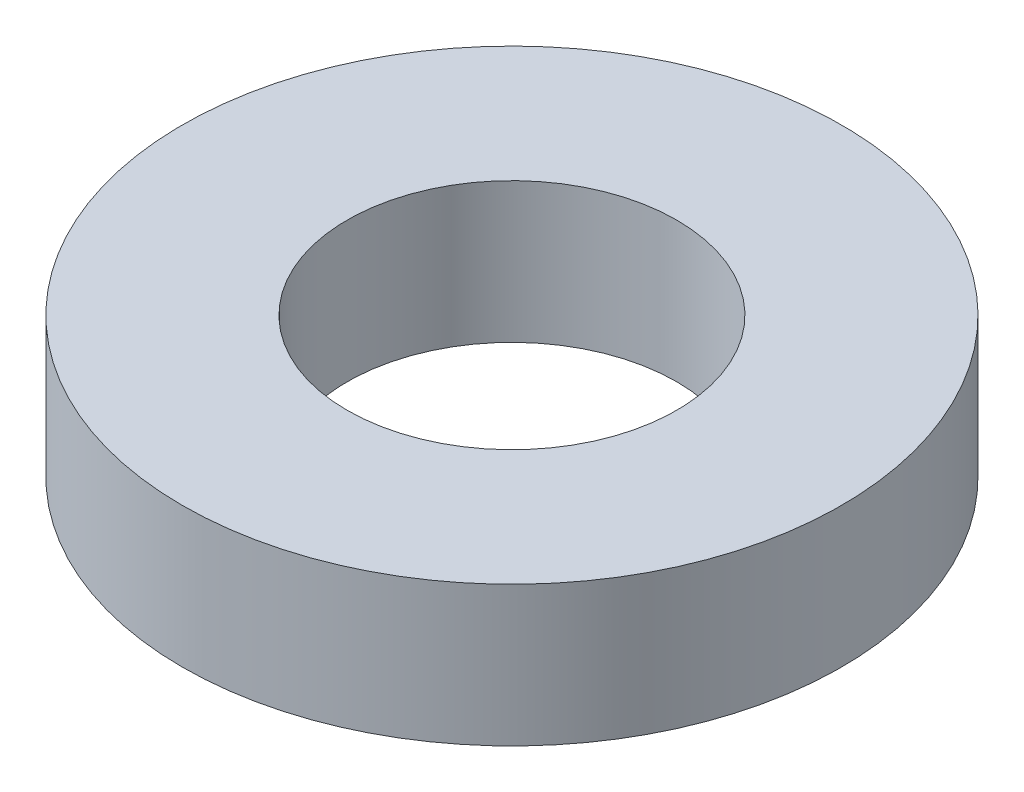
ISO-10303-21;
HEADER;
FILE_DESCRIPTION(('STEP AP214'),'2;1');
FILE_NAME('part.step','',(''),(''),'','','');
FILE_SCHEMA(('AUTOMOTIVE_DESIGN { 1 0 10303 214 1 1 1 1 }'));
ENDSEC;
DATA;
#1=APPLICATION_CONTEXT('core data for automotive mechanical design processes');
#2=APPLICATION_PROTOCOL_DEFINITION('international standard','automotive_design',2000,#1);
#3=PRODUCT_CONTEXT('',#1,'mechanical');
#4=PRODUCT('Part','Part','',(#3));
#5=PRODUCT_RELATED_PRODUCT_CATEGORY('part','',(#4));
#6=PRODUCT_DEFINITION_FORMATION('','',#4);
#7=PRODUCT_DEFINITION_CONTEXT('part definition',#1,'design');
#8=PRODUCT_DEFINITION('design','',#6,#7);
#9=PRODUCT_DEFINITION_SHAPE('','',#8);
#10=(LENGTH_UNIT() NAMED_UNIT(*) SI_UNIT(.MILLI.,.METRE.));
#11=(NAMED_UNIT(*) PLANE_ANGLE_UNIT() SI_UNIT($,.RADIAN.));
#12=(NAMED_UNIT(*) SI_UNIT($,.STERADIAN.) SOLID_ANGLE_UNIT());
#13=UNCERTAINTY_MEASURE_WITH_UNIT(LENGTH_MEASURE(1.E-05),#10,'distance_accuracy_value','');
#14=(GEOMETRIC_REPRESENTATION_CONTEXT(3) GLOBAL_UNCERTAINTY_ASSIGNED_CONTEXT((#13)) GLOBAL_UNIT_ASSIGNED_CONTEXT((#10,
#11,#12)) REPRESENTATION_CONTEXT('',''));
#15=CARTESIAN_POINT('',(0.,0.,0.));
#16=DIRECTION('',(0.,0.,1.));
#17=DIRECTION('',(1.,0.,0.));
#18=AXIS2_PLACEMENT_3D('',#15,#16,#17);
#19=CARTESIAN_POINT('',(0.,17.,0.));
#20=DIRECTION('',(0.,-1.,0.));
#21=DIRECTION('',(0.,0.,-1.));
#22=AXIS2_PLACEMENT_3D('',#19,#20,#21);
#23=CYLINDRICAL_SURFACE('',#22,40.);
#24=CARTESIAN_POINT('',(0.,17.,0.));
#25=DIRECTION('',(0.,1.,0.));
#26=DIRECTION('',(0.,0.,1.));
#27=AXIS2_PLACEMENT_3D('',#24,#25,#26);
#28=CIRCLE('',#27,40.);
#29=CARTESIAN_POINT('',(0.,17.,40.));
#30=VERTEX_POINT('',#29);
#31=EDGE_CURVE('E10',#30,#30,#28,.T.);
#32=ORIENTED_EDGE('',*,*,#31,.F.);
#33=EDGE_LOOP('',(#32));
#34=FACE_BOUND('',#33,.T.);
#35=CARTESIAN_POINT('',(0.,0.,0.));
#36=DIRECTION('',(0.,1.,0.));
#37=DIRECTION('',(0.,0.,1.));
#38=AXIS2_PLACEMENT_3D('',#35,#36,#37);
#39=CIRCLE('',#38,40.);
#40=CARTESIAN_POINT('',(0.,0.,40.));
#41=VERTEX_POINT('',#40);
#42=EDGE_CURVE('E37',#41,#41,#39,.T.);
#43=ORIENTED_EDGE('',*,*,#42,.T.);
#44=EDGE_LOOP('',(#43));
#45=FACE_BOUND('',#44,.T.);
#46=ADVANCED_FACE('F40',(#34,#45),#23,.T.);
#47=CARTESIAN_POINT('',(0.,17.,0.));
#48=DIRECTION('',(0.,1.,0.));
#49=DIRECTION('',(0.,0.,1.));
#50=AXIS2_PLACEMENT_3D('',#47,#48,#49);
#51=PLANE('',#50);
#52=CARTESIAN_POINT('',(0.,17.,0.));
#53=DIRECTION('',(0.,1.,0.));
#54=DIRECTION('',(0.,0.,1.));
#55=AXIS2_PLACEMENT_3D('',#52,#53,#54);
#56=CIRCLE('',#55,20.);
#57=CARTESIAN_POINT('',(0.,17.,20.));
#58=VERTEX_POINT('',#57);
#59=EDGE_CURVE('E50',#58,#58,#56,.T.);
#60=ORIENTED_EDGE('',*,*,#59,.F.);
#61=EDGE_LOOP('',(#60));
#62=FACE_BOUND('',#61,.T.);
#63=ORIENTED_EDGE('',*,*,#31,.T.);
#64=EDGE_LOOP('',(#63));
#65=FACE_BOUND('',#64,.T.);
#66=ADVANCED_FACE('F59',(#62,#65),#51,.T.);
#67=CARTESIAN_POINT('',(0.,0.,0.));
#68=DIRECTION('',(0.,1.,0.));
#69=DIRECTION('',(0.,0.,1.));
#70=AXIS2_PLACEMENT_3D('',#67,#68,#69);
#71=PLANE('',#70);
#72=CARTESIAN_POINT('',(0.,0.,0.));
#73=DIRECTION('',(0.,1.,0.));
#74=DIRECTION('',(0.,0.,1.));
#75=AXIS2_PLACEMENT_3D('',#72,#73,#74);
#76=CIRCLE('',#75,20.);
#77=CARTESIAN_POINT('',(0.,0.,20.));
#78=VERTEX_POINT('',#77);
#79=EDGE_CURVE('E47',#78,#78,#76,.T.);
#80=ORIENTED_EDGE('',*,*,#79,.T.);
#81=EDGE_LOOP('',(#80));
#82=FACE_BOUND('',#81,.T.);
#83=ORIENTED_EDGE('',*,*,#42,.F.);
#84=EDGE_LOOP('',(#83));
#85=FACE_BOUND('',#84,.T.);
#86=ADVANCED_FACE('F58',(#82,#85),#71,.F.);
#87=CARTESIAN_POINT('',(0.,17.,0.));
#88=DIRECTION('',(0.,-1.,0.));
#89=DIRECTION('',(0.,0.,-1.));
#90=AXIS2_PLACEMENT_3D('',#87,#88,#89);
#91=CYLINDRICAL_SURFACE('',#90,20.);
#92=ORIENTED_EDGE('',*,*,#59,.T.);
#93=EDGE_LOOP('',(#92));
#94=FACE_BOUND('',#93,.T.);
#95=ORIENTED_EDGE('',*,*,#79,.F.);
#96=EDGE_LOOP('',(#95));
#97=FACE_BOUND('',#96,.T.);
#98=ADVANCED_FACE('F54',(#94,#97),#91,.F.);
#99=CLOSED_SHELL('',(#46,#66,#86,#98));
#100=MANIFOLD_SOLID_BREP('B2',#99);
#101=ADVANCED_BREP_SHAPE_REPRESENTATION('',(#18,#100),#14);
#102=SHAPE_DEFINITION_REPRESENTATION(#9,#101);
ENDSEC;
END-ISO-10303-21;
